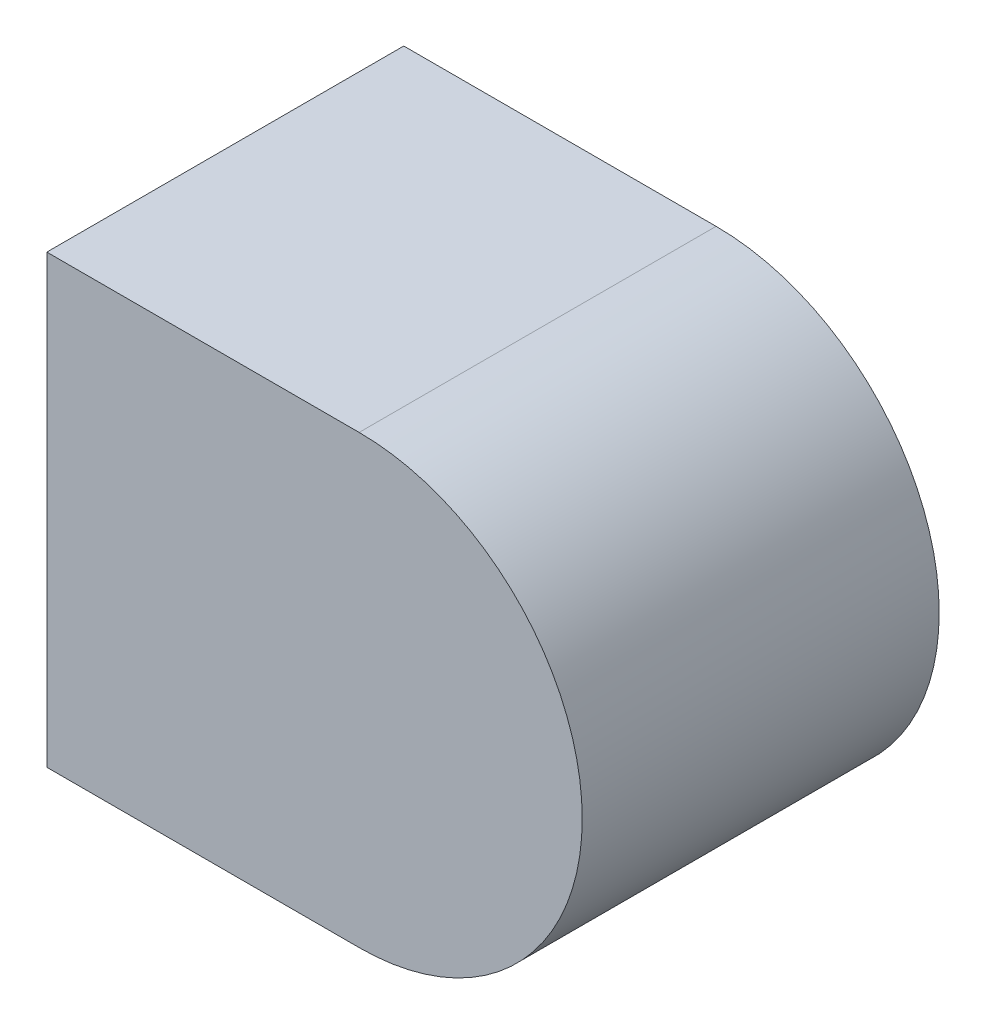
ISO-10303-21;
HEADER;
FILE_DESCRIPTION(('STEP AP214'),'2;1');
FILE_NAME('part.step','',(''),(''),'','','');
FILE_SCHEMA(('AUTOMOTIVE_DESIGN { 1 0 10303 214 1 1 1 1 }'));
ENDSEC;
DATA;
#1=APPLICATION_CONTEXT('core data for automotive mechanical design processes');
#2=APPLICATION_PROTOCOL_DEFINITION('international standard','automotive_design',2000,#1);
#3=PRODUCT_CONTEXT('',#1,'mechanical');
#4=PRODUCT('Part','Part','',(#3));
#5=PRODUCT_RELATED_PRODUCT_CATEGORY('part','',(#4));
#6=PRODUCT_DEFINITION_FORMATION('','',#4);
#7=PRODUCT_DEFINITION_CONTEXT('part definition',#1,'design');
#8=PRODUCT_DEFINITION('design','',#6,#7);
#9=PRODUCT_DEFINITION_SHAPE('','',#8);
#10=(LENGTH_UNIT() NAMED_UNIT(*) SI_UNIT(.MILLI.,.METRE.));
#11=(NAMED_UNIT(*) PLANE_ANGLE_UNIT() SI_UNIT($,.RADIAN.));
#12=(NAMED_UNIT(*) SI_UNIT($,.STERADIAN.) SOLID_ANGLE_UNIT());
#13=UNCERTAINTY_MEASURE_WITH_UNIT(LENGTH_MEASURE(1.E-05),#10,'distance_accuracy_value','');
#14=(GEOMETRIC_REPRESENTATION_CONTEXT(3) GLOBAL_UNCERTAINTY_ASSIGNED_CONTEXT((#13)) GLOBAL_UNIT_ASSIGNED_CONTEXT((#10,
#11,#12)) REPRESENTATION_CONTEXT('',''));
#15=CARTESIAN_POINT('',(0.,0.,0.));
#16=DIRECTION('',(0.,0.,1.));
#17=DIRECTION('',(1.,0.,0.));
#18=AXIS2_PLACEMENT_3D('',#15,#16,#17);
#19=CARTESIAN_POINT('',(-0.703,-0.625,0.));
#20=DIRECTION('',(0.,1.,0.));
#21=DIRECTION('',(-1.,0.,0.));
#22=AXIS2_PLACEMENT_3D('',#19,#20,#21);
#23=PLANE('',#22);
#24=DIRECTION('',(0.,0.,1.));
#25=VECTOR('',#24,1.);
#26=CARTESIAN_POINT('',(-0.828,-0.625,0.));
#27=LINE('',#26,#25);
#28=CARTESIAN_POINT('',(-0.828,-0.625,0.));
#29=VERTEX_POINT('',#28);
#30=CARTESIAN_POINT('',(-0.828,-0.625,0.2));
#31=VERTEX_POINT('',#30);
#32=EDGE_CURVE('E11',#29,#31,#27,.T.);
#33=ORIENTED_EDGE('',*,*,#32,.F.);
#34=DIRECTION('',(-1.,0.,0.));
#35=VECTOR('',#34,1.);
#36=CARTESIAN_POINT('',(-0.703,-0.625,0.));
#37=LINE('',#36,#35);
#38=CARTESIAN_POINT('',(-1.003,-0.625,0.));
#39=VERTEX_POINT('',#38);
#40=EDGE_CURVE('E24',#29,#39,#37,.T.);
#41=ORIENTED_EDGE('',*,*,#40,.T.);
#42=DIRECTION('',(0.,0.,1.));
#43=VECTOR('',#42,1.);
#44=CARTESIAN_POINT('',(-1.003,-0.625,0.));
#45=LINE('',#44,#43);
#46=CARTESIAN_POINT('',(-1.003,-0.625,0.2));
#47=VERTEX_POINT('',#46);
#48=EDGE_CURVE('E88',#39,#47,#45,.T.);
#49=ORIENTED_EDGE('',*,*,#48,.T.);
#50=DIRECTION('',(-1.,0.,0.));
#51=VECTOR('',#50,1.);
#52=CARTESIAN_POINT('',(-0.703,-0.625,0.2));
#53=LINE('',#52,#51);
#54=EDGE_CURVE('E76',#31,#47,#53,.T.);
#55=ORIENTED_EDGE('',*,*,#54,.F.);
#56=EDGE_LOOP('',(#33,#41,#49,#55));
#57=FACE_BOUND('',#56,.T.);
#58=ADVANCED_FACE('F17',(#57),#23,.T.);
#59=CARTESIAN_POINT('',(-0.852999999999999,-0.75,0.));
#60=DIRECTION('',(0.,0.,1.));
#61=DIRECTION('',(1.,0.,0.));
#62=AXIS2_PLACEMENT_3D('',#59,#60,#61);
#63=PLANE('',#62);
#64=CARTESIAN_POINT('',(-0.828,-0.75,0.));
#65=DIRECTION('',(0.,0.,1.));
#66=DIRECTION('',(0.707106781186548,0.707106781186547,0.));
#67=AXIS2_PLACEMENT_3D('',#64,#65,#66);
#68=CIRCLE('',#67,0.125);
#69=CARTESIAN_POINT('',(-0.828,-0.875,0.));
#70=VERTEX_POINT('',#69);
#71=EDGE_CURVE('E85',#70,#29,#68,.T.);
#72=ORIENTED_EDGE('',*,*,#71,.F.);
#73=DIRECTION('',(1.,0.,0.));
#74=VECTOR('',#73,1.);
#75=CARTESIAN_POINT('',(-1.003,-0.875,0.));
#76=LINE('',#75,#74);
#77=CARTESIAN_POINT('',(-1.003,-0.875,0.));
#78=VERTEX_POINT('',#77);
#79=EDGE_CURVE('E83',#78,#70,#76,.T.);
#80=ORIENTED_EDGE('',*,*,#79,.F.);
#81=DIRECTION('',(0.,-1.,0.));
#82=VECTOR('',#81,1.);
#83=CARTESIAN_POINT('',(-1.003,-0.625,0.));
#84=LINE('',#83,#82);
#85=EDGE_CURVE('E72',#39,#78,#84,.T.);
#86=ORIENTED_EDGE('',*,*,#85,.F.);
#87=ORIENTED_EDGE('',*,*,#40,.F.);
#88=EDGE_LOOP('',(#72,#80,#86,#87));
#89=FACE_BOUND('',#88,.T.);
#90=ADVANCED_FACE('F90',(#89),#63,.F.);
#91=CARTESIAN_POINT('',(-0.828,-0.75,0.));
#92=DIRECTION('',(0.,0.,1.));
#93=DIRECTION('',(0.707106781186547,-0.707106781186548,0.));
#94=AXIS2_PLACEMENT_3D('',#91,#92,#93);
#95=CYLINDRICAL_SURFACE('',#94,0.125);
#96=CARTESIAN_POINT('',(-0.828,-0.75,0.2));
#97=DIRECTION('',(0.,0.,-1.));
#98=DIRECTION('',(0.707106781186548,0.707106781186547,0.));
#99=AXIS2_PLACEMENT_3D('',#96,#97,#98);
#100=CIRCLE('',#99,0.125);
#101=CARTESIAN_POINT('',(-0.828,-0.875,0.2));
#102=VERTEX_POINT('',#101);
#103=EDGE_CURVE('E80',#31,#102,#100,.T.);
#104=ORIENTED_EDGE('',*,*,#103,.T.);
#105=DIRECTION('',(0.,0.,-1.));
#106=VECTOR('',#105,1.);
#107=CARTESIAN_POINT('',(-0.828,-0.875,0.));
#108=LINE('',#107,#106);
#109=EDGE_CURVE('E60',#102,#70,#108,.T.);
#110=ORIENTED_EDGE('',*,*,#109,.T.);
#111=ORIENTED_EDGE('',*,*,#71,.T.);
#112=ORIENTED_EDGE('',*,*,#32,.T.);
#113=EDGE_LOOP('',(#104,#110,#111,#112));
#114=FACE_BOUND('',#113,.T.);
#115=ADVANCED_FACE('F91',(#114),#95,.T.);
#116=CARTESIAN_POINT('',(-1.003,-0.875,0.));
#117=DIRECTION('',(0.,-1.,0.));
#118=DIRECTION('',(1.,0.,0.));
#119=AXIS2_PLACEMENT_3D('',#116,#117,#118);
#120=PLANE('',#119);
#121=ORIENTED_EDGE('',*,*,#109,.F.);
#122=DIRECTION('',(1.,0.,0.));
#123=VECTOR('',#122,1.);
#124=CARTESIAN_POINT('',(-1.003,-0.875,0.2));
#125=LINE('',#124,#123);
#126=CARTESIAN_POINT('',(-1.003,-0.875,0.2));
#127=VERTEX_POINT('',#126);
#128=EDGE_CURVE('E54',#127,#102,#125,.T.);
#129=ORIENTED_EDGE('',*,*,#128,.F.);
#130=DIRECTION('',(0.,0.,1.));
#131=VECTOR('',#130,1.);
#132=CARTESIAN_POINT('',(-1.003,-0.875,0.));
#133=LINE('',#132,#131);
#134=EDGE_CURVE('E58',#78,#127,#133,.T.);
#135=ORIENTED_EDGE('',*,*,#134,.F.);
#136=ORIENTED_EDGE('',*,*,#79,.T.);
#137=EDGE_LOOP('',(#121,#129,#135,#136));
#138=FACE_BOUND('',#137,.T.);
#139=ADVANCED_FACE('F56',(#138),#120,.T.);
#140=CARTESIAN_POINT('',(-1.003,-0.625,0.));
#141=DIRECTION('',(-1.,0.,0.));
#142=DIRECTION('',(0.,-1.,0.));
#143=AXIS2_PLACEMENT_3D('',#140,#141,#142);
#144=PLANE('',#143);
#145=ORIENTED_EDGE('',*,*,#85,.T.);
#146=ORIENTED_EDGE('',*,*,#134,.T.);
#147=DIRECTION('',(0.,-1.,0.));
#148=VECTOR('',#147,1.);
#149=CARTESIAN_POINT('',(-1.003,-0.625,0.2));
#150=LINE('',#149,#148);
#151=EDGE_CURVE('E70',#47,#127,#150,.T.);
#152=ORIENTED_EDGE('',*,*,#151,.F.);
#153=ORIENTED_EDGE('',*,*,#48,.F.);
#154=EDGE_LOOP('',(#145,#146,#152,#153));
#155=FACE_BOUND('',#154,.T.);
#156=ADVANCED_FACE('F68',(#155),#144,.T.);
#157=CARTESIAN_POINT('',(-0.852999999999999,-0.75,0.2));
#158=DIRECTION('',(0.,0.,1.));
#159=DIRECTION('',(1.,0.,0.));
#160=AXIS2_PLACEMENT_3D('',#157,#158,#159);
#161=PLANE('',#160);
#162=ORIENTED_EDGE('',*,*,#103,.F.);
#163=ORIENTED_EDGE('',*,*,#54,.T.);
#164=ORIENTED_EDGE('',*,*,#151,.T.);
#165=ORIENTED_EDGE('',*,*,#128,.T.);
#166=EDGE_LOOP('',(#162,#163,#164,#165));
#167=FACE_BOUND('',#166,.T.);
#168=ADVANCED_FACE('F75',(#167),#161,.T.);
#169=CLOSED_SHELL('',(#58,#90,#115,#139,#156,#168));
#170=MANIFOLD_SOLID_BREP('B1',#169);
#171=ADVANCED_BREP_SHAPE_REPRESENTATION('',(#18,#170),#14);
#172=SHAPE_DEFINITION_REPRESENTATION(#9,#171);
ENDSEC;
END-ISO-10303-21;
